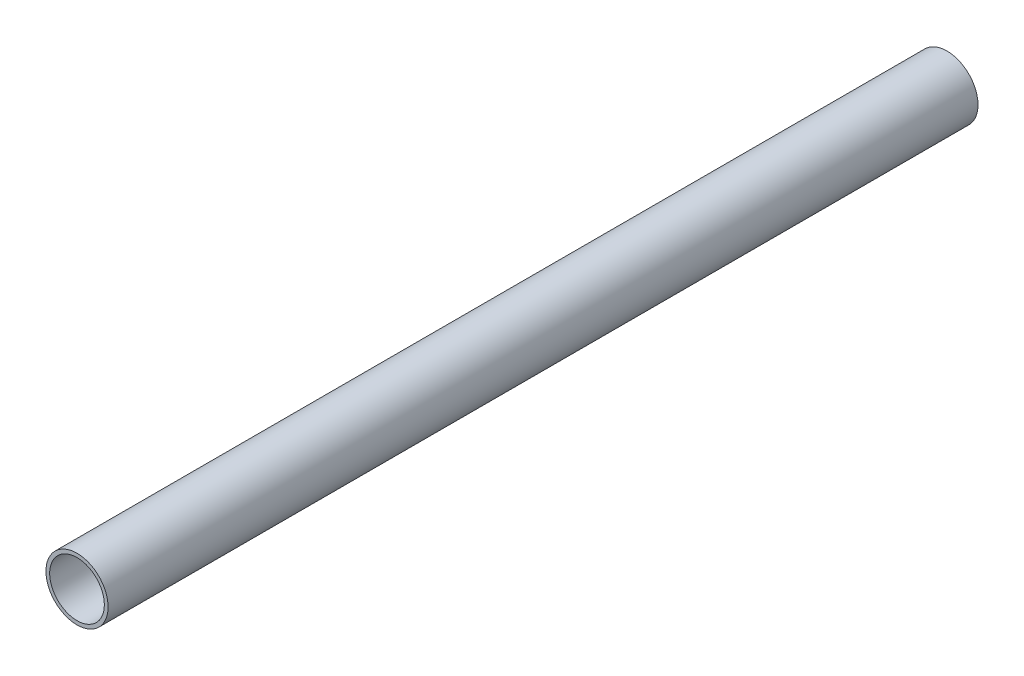
ISO-10303-21;
HEADER;
FILE_DESCRIPTION(('STEP AP214'),'2;1');
FILE_NAME('part.step','',(''),(''),'','','');
FILE_SCHEMA(('AUTOMOTIVE_DESIGN { 1 0 10303 214 1 1 1 1 }'));
ENDSEC;
DATA;
#1=APPLICATION_CONTEXT('core data for automotive mechanical design processes');
#2=APPLICATION_PROTOCOL_DEFINITION('international standard','automotive_design',2000,#1);
#3=PRODUCT_CONTEXT('',#1,'mechanical');
#4=PRODUCT('Part','Part','',(#3));
#5=PRODUCT_RELATED_PRODUCT_CATEGORY('part','',(#4));
#6=PRODUCT_DEFINITION_FORMATION('','',#4);
#7=PRODUCT_DEFINITION_CONTEXT('part definition',#1,'design');
#8=PRODUCT_DEFINITION('design','',#6,#7);
#9=PRODUCT_DEFINITION_SHAPE('','',#8);
#10=(LENGTH_UNIT() NAMED_UNIT(*) SI_UNIT(.MILLI.,.METRE.));
#11=(NAMED_UNIT(*) PLANE_ANGLE_UNIT() SI_UNIT($,.RADIAN.));
#12=(NAMED_UNIT(*) SI_UNIT($,.STERADIAN.) SOLID_ANGLE_UNIT());
#13=UNCERTAINTY_MEASURE_WITH_UNIT(LENGTH_MEASURE(1.E-05),#10,'distance_accuracy_value','');
#14=(GEOMETRIC_REPRESENTATION_CONTEXT(3) GLOBAL_UNCERTAINTY_ASSIGNED_CONTEXT((#13)) GLOBAL_UNIT_ASSIGNED_CONTEXT((#10,
#11,#12)) REPRESENTATION_CONTEXT('',''));
#15=CARTESIAN_POINT('',(0.,0.,0.));
#16=DIRECTION('',(0.,0.,1.));
#17=DIRECTION('',(1.,0.,0.));
#18=AXIS2_PLACEMENT_3D('',#15,#16,#17);
#19=CARTESIAN_POINT('',(0.,0.,350.));
#20=DIRECTION('',(0.,0.,1.));
#21=DIRECTION('',(1.,0.,0.));
#22=AXIS2_PLACEMENT_3D('',#19,#20,#21);
#23=PLANE('',#22);
#24=CARTESIAN_POINT('',(0.,0.,350.));
#25=DIRECTION('',(0.,0.,1.));
#26=DIRECTION('',(1.,0.,0.));
#27=AXIS2_PLACEMENT_3D('',#24,#25,#26);
#28=CIRCLE('',#27,12.5);
#29=CARTESIAN_POINT('',(12.5,0.,350.));
#30=VERTEX_POINT('',#29);
#31=EDGE_CURVE('E10',#30,#30,#28,.T.);
#32=ORIENTED_EDGE('',*,*,#31,.T.);
#33=EDGE_LOOP('',(#32));
#34=FACE_BOUND('',#33,.T.);
#35=CARTESIAN_POINT('',(0.,0.,350.));
#36=DIRECTION('',(0.,0.,1.));
#37=DIRECTION('',(1.,0.,0.));
#38=AXIS2_PLACEMENT_3D('',#35,#36,#37);
#39=CIRCLE('',#38,11.);
#40=CARTESIAN_POINT('',(11.,0.,350.));
#41=VERTEX_POINT('',#40);
#42=EDGE_CURVE('E50',#41,#41,#39,.T.);
#43=ORIENTED_EDGE('',*,*,#42,.F.);
#44=EDGE_LOOP('',(#43));
#45=FACE_BOUND('',#44,.T.);
#46=ADVANCED_FACE('F39',(#34,#45),#23,.T.);
#47=CARTESIAN_POINT('',(0.,0.,0.));
#48=DIRECTION('',(0.,0.,1.));
#49=DIRECTION('',(1.,0.,0.));
#50=AXIS2_PLACEMENT_3D('',#47,#48,#49);
#51=PLANE('',#50);
#52=CARTESIAN_POINT('',(0.,0.,0.));
#53=DIRECTION('',(0.,0.,1.));
#54=DIRECTION('',(1.,0.,0.));
#55=AXIS2_PLACEMENT_3D('',#52,#53,#54);
#56=CIRCLE('',#55,12.5);
#57=CARTESIAN_POINT('',(12.5,0.,0.));
#58=VERTEX_POINT('',#57);
#59=EDGE_CURVE('E43',#58,#58,#56,.T.);
#60=ORIENTED_EDGE('',*,*,#59,.F.);
#61=EDGE_LOOP('',(#60));
#62=FACE_BOUND('',#61,.T.);
#63=CARTESIAN_POINT('',(0.,0.,0.));
#64=DIRECTION('',(0.,0.,1.));
#65=DIRECTION('',(1.,0.,0.));
#66=AXIS2_PLACEMENT_3D('',#63,#64,#65);
#67=CIRCLE('',#66,11.);
#68=CARTESIAN_POINT('',(11.,0.,0.));
#69=VERTEX_POINT('',#68);
#70=EDGE_CURVE('E52',#69,#69,#67,.T.);
#71=ORIENTED_EDGE('',*,*,#70,.T.);
#72=EDGE_LOOP('',(#71));
#73=FACE_BOUND('',#72,.T.);
#74=ADVANCED_FACE('F62',(#62,#73),#51,.F.);
#75=CARTESIAN_POINT('',(0.,0.,350.));
#76=DIRECTION('',(0.,0.,-1.));
#77=DIRECTION('',(-1.,0.,0.));
#78=AXIS2_PLACEMENT_3D('',#75,#76,#77);
#79=CYLINDRICAL_SURFACE('',#78,12.5);
#80=ORIENTED_EDGE('',*,*,#31,.F.);
#81=EDGE_LOOP('',(#80));
#82=FACE_BOUND('',#81,.T.);
#83=ORIENTED_EDGE('',*,*,#59,.T.);
#84=EDGE_LOOP('',(#83));
#85=FACE_BOUND('',#84,.T.);
#86=ADVANCED_FACE('F41',(#82,#85),#79,.T.);
#87=CARTESIAN_POINT('',(0.,0.,350.));
#88=DIRECTION('',(0.,0.,-1.));
#89=DIRECTION('',(-1.,0.,0.));
#90=AXIS2_PLACEMENT_3D('',#87,#88,#89);
#91=CYLINDRICAL_SURFACE('',#90,11.);
#92=ORIENTED_EDGE('',*,*,#42,.T.);
#93=EDGE_LOOP('',(#92));
#94=FACE_BOUND('',#93,.T.);
#95=ORIENTED_EDGE('',*,*,#70,.F.);
#96=EDGE_LOOP('',(#95));
#97=FACE_BOUND('',#96,.T.);
#98=ADVANCED_FACE('F58',(#94,#97),#91,.F.);
#99=CLOSED_SHELL('',(#46,#74,#86,#98));
#100=MANIFOLD_SOLID_BREP('B2',#99);
#101=ADVANCED_BREP_SHAPE_REPRESENTATION('',(#18,#100),#14);
#102=SHAPE_DEFINITION_REPRESENTATION(#9,#101);
ENDSEC;
END-ISO-10303-21;
